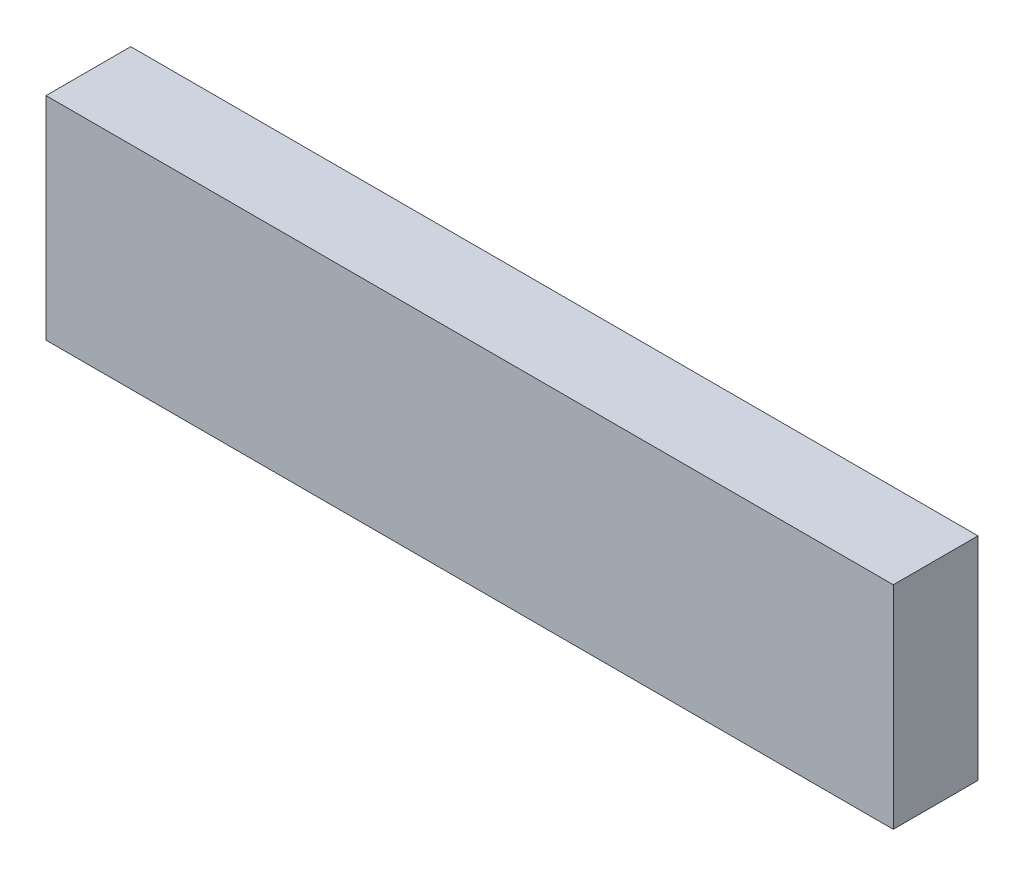
ISO-10303-21;
HEADER;
FILE_DESCRIPTION(('STEP AP214'),'2;1');
FILE_NAME('part.step','',(''),(''),'','','');
FILE_SCHEMA(('AUTOMOTIVE_DESIGN { 1 0 10303 214 1 1 1 1 }'));
ENDSEC;
DATA;
#1=APPLICATION_CONTEXT('core data for automotive mechanical design processes');
#2=APPLICATION_PROTOCOL_DEFINITION('international standard','automotive_design',2000,#1);
#3=PRODUCT_CONTEXT('',#1,'mechanical');
#4=PRODUCT('Part','Part','',(#3));
#5=PRODUCT_RELATED_PRODUCT_CATEGORY('part','',(#4));
#6=PRODUCT_DEFINITION_FORMATION('','',#4);
#7=PRODUCT_DEFINITION_CONTEXT('part definition',#1,'design');
#8=PRODUCT_DEFINITION('design','',#6,#7);
#9=PRODUCT_DEFINITION_SHAPE('','',#8);
#10=(LENGTH_UNIT() NAMED_UNIT(*) SI_UNIT(.MILLI.,.METRE.));
#11=(NAMED_UNIT(*) PLANE_ANGLE_UNIT() SI_UNIT($,.RADIAN.));
#12=(NAMED_UNIT(*) SI_UNIT($,.STERADIAN.) SOLID_ANGLE_UNIT());
#13=UNCERTAINTY_MEASURE_WITH_UNIT(LENGTH_MEASURE(1.E-05),#10,'distance_accuracy_value','');
#14=(GEOMETRIC_REPRESENTATION_CONTEXT(3) GLOBAL_UNCERTAINTY_ASSIGNED_CONTEXT((#13)) GLOBAL_UNIT_ASSIGNED_CONTEXT((#10,
#11,#12)) REPRESENTATION_CONTEXT('',''));
#15=CARTESIAN_POINT('',(0.,0.,0.));
#16=DIRECTION('',(0.,0.,1.));
#17=DIRECTION('',(1.,0.,0.));
#18=AXIS2_PLACEMENT_3D('',#15,#16,#17);
#19=CARTESIAN_POINT('',(-108.,-50.01,55.8));
#20=DIRECTION('',(0.,0.,-1.));
#21=DIRECTION('',(-1.,0.,0.));
#22=AXIS2_PLACEMENT_3D('',#19,#20,#21);
#23=PLANE('',#22);
#24=DIRECTION('',(0.,1.,0.));
#25=VECTOR('',#24,1.);
#26=CARTESIAN_POINT('',(-108.,-50.01,55.8));
#27=LINE('',#26,#25);
#28=CARTESIAN_POINT('',(-108.,-50.,55.8));
#29=VERTEX_POINT('',#28);
#30=CARTESIAN_POINT('',(-108.,-47.,55.8));
#31=VERTEX_POINT('',#30);
#32=EDGE_CURVE('E86',#29,#31,#27,.T.);
#33=ORIENTED_EDGE('',*,*,#32,.T.);
#34=DIRECTION('',(1.,0.,0.));
#35=VECTOR('',#34,1.);
#36=CARTESIAN_POINT('',(-300.,-47.,55.8));
#37=LINE('',#36,#35);
#38=CARTESIAN_POINT('',(-96.,-47.,55.8));
#39=VERTEX_POINT('',#38);
#40=EDGE_CURVE('E82',#31,#39,#37,.T.);
#41=ORIENTED_EDGE('',*,*,#40,.T.);
#42=DIRECTION('',(0.,1.,0.));
#43=VECTOR('',#42,1.);
#44=CARTESIAN_POINT('',(-96.,-50.01,55.8));
#45=LINE('',#44,#43);
#46=CARTESIAN_POINT('',(-96.,-50.,55.8));
#47=VERTEX_POINT('',#46);
#48=EDGE_CURVE('E78',#47,#39,#45,.T.);
#49=ORIENTED_EDGE('',*,*,#48,.F.);
#50=DIRECTION('',(-1.,0.,0.));
#51=VECTOR('',#50,1.);
#52=CARTESIAN_POINT('',(-300.,-50.,55.8));
#53=LINE('',#52,#51);
#54=EDGE_CURVE('E11',#47,#29,#53,.T.);
#55=ORIENTED_EDGE('',*,*,#54,.T.);
#56=EDGE_LOOP('',(#33,#41,#49,#55));
#57=FACE_BOUND('',#56,.T.);
#58=ADVANCED_FACE('F35',(#57),#23,.T.);
#59=CARTESIAN_POINT('',(-108.,-50.01,55.8));
#60=DIRECTION('',(-1.,0.,0.));
#61=DIRECTION('',(0.,0.,1.));
#62=AXIS2_PLACEMENT_3D('',#59,#60,#61);
#63=PLANE('',#62);
#64=DIRECTION('',(0.,1.,0.));
#65=VECTOR('',#64,1.);
#66=CARTESIAN_POINT('',(-108.,-50.01,57.));
#67=LINE('',#66,#65);
#68=CARTESIAN_POINT('',(-108.,-50.,57.));
#69=VERTEX_POINT('',#68);
#70=CARTESIAN_POINT('',(-108.,-47.,57.));
#71=VERTEX_POINT('',#70);
#72=EDGE_CURVE('E52',#69,#71,#67,.T.);
#73=ORIENTED_EDGE('',*,*,#72,.T.);
#74=DIRECTION('',(0.,0.,-1.));
#75=VECTOR('',#74,1.);
#76=CARTESIAN_POINT('',(-108.,-47.,3.));
#77=LINE('',#76,#75);
#78=EDGE_CURVE('E39',#71,#31,#77,.T.);
#79=ORIENTED_EDGE('',*,*,#78,.T.);
#80=ORIENTED_EDGE('',*,*,#32,.F.);
#81=DIRECTION('',(0.,0.,1.));
#82=VECTOR('',#81,1.);
#83=CARTESIAN_POINT('',(-108.,-50.,60.));
#84=LINE('',#83,#82);
#85=EDGE_CURVE('E92',#29,#69,#84,.T.);
#86=ORIENTED_EDGE('',*,*,#85,.T.);
#87=EDGE_LOOP('',(#73,#79,#80,#86));
#88=FACE_BOUND('',#87,.T.);
#89=ADVANCED_FACE('F37',(#88),#63,.T.);
#90=CARTESIAN_POINT('',(-96.,-50.01,55.8));
#91=DIRECTION('',(1.,0.,0.));
#92=DIRECTION('',(0.,0.,-1.));
#93=AXIS2_PLACEMENT_3D('',#90,#91,#92);
#94=PLANE('',#93);
#95=ORIENTED_EDGE('',*,*,#48,.T.);
#96=DIRECTION('',(0.,0.,1.));
#97=VECTOR('',#96,1.);
#98=CARTESIAN_POINT('',(-96.,-47.,3.));
#99=LINE('',#98,#97);
#100=CARTESIAN_POINT('',(-96.,-47.,57.));
#101=VERTEX_POINT('',#100);
#102=EDGE_CURVE('E103',#39,#101,#99,.T.);
#103=ORIENTED_EDGE('',*,*,#102,.T.);
#104=DIRECTION('',(0.,1.,0.));
#105=VECTOR('',#104,1.);
#106=CARTESIAN_POINT('',(-96.,-50.01,57.));
#107=LINE('',#106,#105);
#108=CARTESIAN_POINT('',(-96.,-50.,57.));
#109=VERTEX_POINT('',#108);
#110=EDGE_CURVE('E59',#109,#101,#107,.T.);
#111=ORIENTED_EDGE('',*,*,#110,.F.);
#112=DIRECTION('',(0.,0.,-1.));
#113=VECTOR('',#112,1.);
#114=CARTESIAN_POINT('',(-96.,-50.,60.));
#115=LINE('',#114,#113);
#116=EDGE_CURVE('E44',#109,#47,#115,.T.);
#117=ORIENTED_EDGE('',*,*,#116,.T.);
#118=EDGE_LOOP('',(#95,#103,#111,#117));
#119=FACE_BOUND('',#118,.T.);
#120=ADVANCED_FACE('F93',(#119),#94,.T.);
#121=CARTESIAN_POINT('',(-108.,-50.01,57.));
#122=DIRECTION('',(0.,0.,1.));
#123=DIRECTION('',(1.,0.,0.));
#124=AXIS2_PLACEMENT_3D('',#121,#122,#123);
#125=PLANE('',#124);
#126=ORIENTED_EDGE('',*,*,#110,.T.);
#127=DIRECTION('',(-1.,0.,0.));
#128=VECTOR('',#127,1.);
#129=CARTESIAN_POINT('',(-300.,-47.,57.));
#130=LINE('',#129,#128);
#131=EDGE_CURVE('E104',#101,#71,#130,.T.);
#132=ORIENTED_EDGE('',*,*,#131,.T.);
#133=ORIENTED_EDGE('',*,*,#72,.F.);
#134=DIRECTION('',(1.,0.,0.));
#135=VECTOR('',#134,1.);
#136=CARTESIAN_POINT('',(-300.,-50.,57.));
#137=LINE('',#136,#135);
#138=EDGE_CURVE('E94',#69,#109,#137,.T.);
#139=ORIENTED_EDGE('',*,*,#138,.T.);
#140=EDGE_LOOP('',(#126,#132,#133,#139));
#141=FACE_BOUND('',#140,.T.);
#142=ADVANCED_FACE('F114',(#141),#125,.T.);
#143=CARTESIAN_POINT('',(-300.,-50.,60.));
#144=DIRECTION('',(0.,1.,0.));
#145=DIRECTION('',(0.,0.,1.));
#146=AXIS2_PLACEMENT_3D('',#143,#144,#145);
#147=PLANE('',#146);
#148=ORIENTED_EDGE('',*,*,#85,.F.);
#149=ORIENTED_EDGE('',*,*,#54,.F.);
#150=ORIENTED_EDGE('',*,*,#116,.F.);
#151=ORIENTED_EDGE('',*,*,#138,.F.);
#152=EDGE_LOOP('',(#148,#149,#150,#151));
#153=FACE_BOUND('',#152,.T.);
#154=ADVANCED_FACE('F90',(#153),#147,.F.);
#155=CARTESIAN_POINT('',(-300.,-47.,3.));
#156=DIRECTION('',(0.,-1.,0.));
#157=DIRECTION('',(0.,0.,-1.));
#158=AXIS2_PLACEMENT_3D('',#155,#156,#157);
#159=PLANE('',#158);
#160=ORIENTED_EDGE('',*,*,#78,.F.);
#161=ORIENTED_EDGE('',*,*,#131,.F.);
#162=ORIENTED_EDGE('',*,*,#102,.F.);
#163=ORIENTED_EDGE('',*,*,#40,.F.);
#164=EDGE_LOOP('',(#160,#161,#162,#163));
#165=FACE_BOUND('',#164,.T.);
#166=ADVANCED_FACE('F108',(#165),#159,.F.);
#167=CLOSED_SHELL('',(#58,#89,#120,#142,#154,#166));
#168=MANIFOLD_SOLID_BREP('B2',#167);
#169=ADVANCED_BREP_SHAPE_REPRESENTATION('',(#18,#168),#14);
#170=SHAPE_DEFINITION_REPRESENTATION(#9,#169);
ENDSEC;
END-ISO-10303-21;
